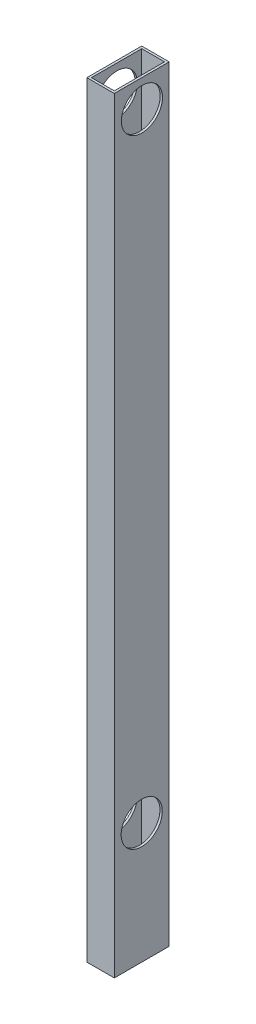
ISO-10303-21;
HEADER;
FILE_DESCRIPTION(('STEP AP214'),'2;1');
FILE_NAME('part.step','',(''),(''),'','','');
FILE_SCHEMA(('AUTOMOTIVE_DESIGN { 1 0 10303 214 1 1 1 1 }'));
ENDSEC;
DATA;
#1=APPLICATION_CONTEXT('core data for automotive mechanical design processes');
#2=APPLICATION_PROTOCOL_DEFINITION('international standard','automotive_design',2000,#1);
#3=PRODUCT_CONTEXT('',#1,'mechanical');
#4=PRODUCT('Part','Part','',(#3));
#5=PRODUCT_RELATED_PRODUCT_CATEGORY('part','',(#4));
#6=PRODUCT_DEFINITION_FORMATION('','',#4);
#7=PRODUCT_DEFINITION_CONTEXT('part definition',#1,'design');
#8=PRODUCT_DEFINITION('design','',#6,#7);
#9=PRODUCT_DEFINITION_SHAPE('','',#8);
#10=(LENGTH_UNIT() NAMED_UNIT(*) SI_UNIT(.MILLI.,.METRE.));
#11=(NAMED_UNIT(*) PLANE_ANGLE_UNIT() SI_UNIT($,.RADIAN.));
#12=(NAMED_UNIT(*) SI_UNIT($,.STERADIAN.) SOLID_ANGLE_UNIT());
#13=UNCERTAINTY_MEASURE_WITH_UNIT(LENGTH_MEASURE(1.E-05),#10,'distance_accuracy_value','');
#14=(GEOMETRIC_REPRESENTATION_CONTEXT(3) GLOBAL_UNCERTAINTY_ASSIGNED_CONTEXT((#13)) GLOBAL_UNIT_ASSIGNED_CONTEXT((#10,
#11,#12)) REPRESENTATION_CONTEXT('',''));
#15=CARTESIAN_POINT('',(0.,0.,0.));
#16=DIRECTION('',(0.,0.,1.));
#17=DIRECTION('',(1.,0.,0.));
#18=AXIS2_PLACEMENT_3D('',#15,#16,#17);
#19=CARTESIAN_POINT('',(0.,457.2,0.));
#20=DIRECTION('',(0.,1.,0.));
#21=DIRECTION('',(0.,0.,1.));
#22=AXIS2_PLACEMENT_3D('',#19,#20,#21);
#23=PLANE('',#22);
#24=DIRECTION('',(0.,0.,1.));
#25=VECTOR('',#24,1.);
#26=CARTESIAN_POINT('',(0.,457.2,0.));
#27=LINE('',#26,#25);
#28=CARTESIAN_POINT('',(0.,457.2,-38.1));
#29=VERTEX_POINT('',#28);
#30=CARTESIAN_POINT('',(0.,457.2,0.));
#31=VERTEX_POINT('',#30);
#32=EDGE_CURVE('E200',#29,#31,#27,.T.);
#33=ORIENTED_EDGE('',*,*,#32,.T.);
#34=DIRECTION('',(1.,0.,0.));
#35=VECTOR('',#34,1.);
#36=CARTESIAN_POINT('',(0.,457.2,0.));
#37=LINE('',#36,#35);
#38=CARTESIAN_POINT('',(19.05,457.2,0.));
#39=VERTEX_POINT('',#38);
#40=EDGE_CURVE('E202',#31,#39,#37,.T.);
#41=ORIENTED_EDGE('',*,*,#40,.T.);
#42=DIRECTION('',(0.,0.,-1.));
#43=VECTOR('',#42,1.);
#44=CARTESIAN_POINT('',(19.05,457.2,0.));
#45=LINE('',#44,#43);
#46=CARTESIAN_POINT('',(19.05,457.2,-38.1));
#47=VERTEX_POINT('',#46);
#48=EDGE_CURVE('E204',#39,#47,#45,.T.);
#49=ORIENTED_EDGE('',*,*,#48,.T.);
#50=DIRECTION('',(-1.,0.,0.));
#51=VECTOR('',#50,1.);
#52=CARTESIAN_POINT('',(0.,457.2,-38.1));
#53=LINE('',#52,#51);
#54=EDGE_CURVE('E106',#47,#29,#53,.T.);
#55=ORIENTED_EDGE('',*,*,#54,.T.);
#56=EDGE_LOOP('',(#33,#41,#49,#55));
#57=FACE_BOUND('',#56,.T.);
#58=DIRECTION('',(1.,0.,0.));
#59=VECTOR('',#58,1.);
#60=CARTESIAN_POINT('',(0.,457.2,-1.5875));
#61=LINE('',#60,#59);
#62=CARTESIAN_POINT('',(1.5875,457.2,-1.5875));
#63=VERTEX_POINT('',#62);
#64=CARTESIAN_POINT('',(17.4625,457.2,-1.5875));
#65=VERTEX_POINT('',#64);
#66=EDGE_CURVE('E156',#63,#65,#61,.T.);
#67=ORIENTED_EDGE('',*,*,#66,.F.);
#68=DIRECTION('',(0.,0.,1.));
#69=VECTOR('',#68,1.);
#70=CARTESIAN_POINT('',(1.5875,457.2,0.));
#71=LINE('',#70,#69);
#72=CARTESIAN_POINT('',(1.5875,457.2,-36.5125));
#73=VERTEX_POINT('',#72);
#74=EDGE_CURVE('E189',#73,#63,#71,.T.);
#75=ORIENTED_EDGE('',*,*,#74,.F.);
#76=DIRECTION('',(-1.,0.,0.));
#77=VECTOR('',#76,1.);
#78=CARTESIAN_POINT('',(0.,457.2,-36.5125));
#79=LINE('',#78,#77);
#80=CARTESIAN_POINT('',(17.4625,457.2,-36.5125));
#81=VERTEX_POINT('',#80);
#82=EDGE_CURVE('E194',#81,#73,#79,.T.);
#83=ORIENTED_EDGE('',*,*,#82,.F.);
#84=DIRECTION('',(0.,0.,-1.));
#85=VECTOR('',#84,1.);
#86=CARTESIAN_POINT('',(17.4625,457.2,0.));
#87=LINE('',#86,#85);
#88=EDGE_CURVE('E192',#65,#81,#87,.T.);
#89=ORIENTED_EDGE('',*,*,#88,.F.);
#90=EDGE_LOOP('',(#67,#75,#83,#89));
#91=FACE_BOUND('',#90,.T.);
#92=ADVANCED_FACE('F81',(#57,#91),#23,.T.);
#93=CARTESIAN_POINT('',(0.,457.2,0.));
#94=DIRECTION('',(1.,0.,0.));
#95=DIRECTION('',(0.,0.,-1.));
#96=AXIS2_PLACEMENT_3D('',#93,#94,#95);
#97=PLANE('',#96);
#98=CARTESIAN_POINT('',(0.,8.63599999999998,-19.05));
#99=DIRECTION('',(1.,0.,0.));
#100=DIRECTION('',(0.,0.,-1.));
#101=AXIS2_PLACEMENT_3D('',#98,#99,#100);
#102=CIRCLE('',#101,14.2875);
#103=CARTESIAN_POINT('',(0.,8.63599999999998,-33.3375));
#104=VERTEX_POINT('',#103);
#105=EDGE_CURVE('E231',#104,#104,#102,.T.);
#106=ORIENTED_EDGE('',*,*,#105,.T.);
#107=EDGE_LOOP('',(#106));
#108=FACE_BOUND('',#107,.T.);
#109=CARTESIAN_POINT('',(0.,438.15,-19.2024));
#110=DIRECTION('',(1.,0.,0.));
#111=DIRECTION('',(0.,0.,-1.));
#112=AXIS2_PLACEMENT_3D('',#109,#110,#111);
#113=CIRCLE('',#112,14.2875);
#114=CARTESIAN_POINT('',(0.,438.15,-33.4899));
#115=VERTEX_POINT('',#114);
#116=EDGE_CURVE('E213',#115,#115,#113,.T.);
#117=ORIENTED_EDGE('',*,*,#116,.T.);
#118=EDGE_LOOP('',(#117));
#119=FACE_BOUND('',#118,.T.);
#120=DIRECTION('',(0.,-1.,0.));
#121=VECTOR('',#120,1.);
#122=CARTESIAN_POINT('',(0.,457.2,-38.1));
#123=LINE('',#122,#121);
#124=CARTESIAN_POINT('',(0.,-75.184,-38.1));
#125=VERTEX_POINT('',#124);
#126=EDGE_CURVE('E207',#29,#125,#123,.T.);
#127=ORIENTED_EDGE('',*,*,#126,.T.);
#128=DIRECTION('',(0.,0.,-1.));
#129=VECTOR('',#128,1.);
#130=CARTESIAN_POINT('',(0.,-75.184,-38.1));
#131=LINE('',#130,#129);
#132=CARTESIAN_POINT('',(0.,-75.184,0.));
#133=VERTEX_POINT('',#132);
#134=EDGE_CURVE('E183',#133,#125,#131,.T.);
#135=ORIENTED_EDGE('',*,*,#134,.F.);
#136=DIRECTION('',(0.,-1.,0.));
#137=VECTOR('',#136,1.);
#138=CARTESIAN_POINT('',(0.,457.2,0.));
#139=LINE('',#138,#137);
#140=EDGE_CURVE('E12',#31,#133,#139,.T.);
#141=ORIENTED_EDGE('',*,*,#140,.F.);
#142=ORIENTED_EDGE('',*,*,#32,.F.);
#143=EDGE_LOOP('',(#127,#135,#141,#142));
#144=FACE_BOUND('',#143,.T.);
#145=ADVANCED_FACE('F83',(#108,#119,#144),#97,.F.);
#146=CARTESIAN_POINT('',(0.,457.2,0.));
#147=DIRECTION('',(0.,0.,-1.));
#148=DIRECTION('',(-1.,0.,0.));
#149=AXIS2_PLACEMENT_3D('',#146,#147,#148);
#150=PLANE('',#149);
#151=ORIENTED_EDGE('',*,*,#140,.T.);
#152=DIRECTION('',(-1.,0.,0.));
#153=VECTOR('',#152,1.);
#154=CARTESIAN_POINT('',(19.05,-75.184,0.));
#155=LINE('',#154,#153);
#156=CARTESIAN_POINT('',(19.05,-75.184,0.));
#157=VERTEX_POINT('',#156);
#158=EDGE_CURVE('E180',#157,#133,#155,.T.);
#159=ORIENTED_EDGE('',*,*,#158,.F.);
#160=DIRECTION('',(0.,-1.,0.));
#161=VECTOR('',#160,1.);
#162=CARTESIAN_POINT('',(19.05,457.2,0.));
#163=LINE('',#162,#161);
#164=EDGE_CURVE('E90',#39,#157,#163,.T.);
#165=ORIENTED_EDGE('',*,*,#164,.F.);
#166=ORIENTED_EDGE('',*,*,#40,.F.);
#167=EDGE_LOOP('',(#151,#159,#165,#166));
#168=FACE_BOUND('',#167,.T.);
#169=ADVANCED_FACE('F257',(#168),#150,.F.);
#170=CARTESIAN_POINT('',(19.05,457.2,0.));
#171=DIRECTION('',(-1.,0.,0.));
#172=DIRECTION('',(0.,0.,1.));
#173=AXIS2_PLACEMENT_3D('',#170,#171,#172);
#174=PLANE('',#173);
#175=CARTESIAN_POINT('',(19.05,8.63599999999998,-19.05));
#176=DIRECTION('',(1.,0.,0.));
#177=DIRECTION('',(0.,0.,-1.));
#178=AXIS2_PLACEMENT_3D('',#175,#176,#177);
#179=CIRCLE('',#178,14.2875);
#180=CARTESIAN_POINT('',(19.05,8.63599999999998,-33.3375));
#181=VERTEX_POINT('',#180);
#182=EDGE_CURVE('E228',#181,#181,#179,.T.);
#183=ORIENTED_EDGE('',*,*,#182,.F.);
#184=EDGE_LOOP('',(#183));
#185=FACE_BOUND('',#184,.T.);
#186=CARTESIAN_POINT('',(19.05,438.15,-19.2024));
#187=DIRECTION('',(1.,0.,0.));
#188=DIRECTION('',(0.,0.,-1.));
#189=AXIS2_PLACEMENT_3D('',#186,#187,#188);
#190=CIRCLE('',#189,14.2875);
#191=CARTESIAN_POINT('',(19.05,438.15,-33.4899));
#192=VERTEX_POINT('',#191);
#193=EDGE_CURVE('E218',#192,#192,#190,.T.);
#194=ORIENTED_EDGE('',*,*,#193,.F.);
#195=EDGE_LOOP('',(#194));
#196=FACE_BOUND('',#195,.T.);
#197=ORIENTED_EDGE('',*,*,#164,.T.);
#198=DIRECTION('',(0.,0.,1.));
#199=VECTOR('',#198,1.);
#200=CARTESIAN_POINT('',(19.05,-75.184,-38.1));
#201=LINE('',#200,#199);
#202=CARTESIAN_POINT('',(19.05,-75.184,-38.1));
#203=VERTEX_POINT('',#202);
#204=EDGE_CURVE('E177',#203,#157,#201,.T.);
#205=ORIENTED_EDGE('',*,*,#204,.F.);
#206=DIRECTION('',(0.,-1.,0.));
#207=VECTOR('',#206,1.);
#208=CARTESIAN_POINT('',(19.05,457.2,-38.1));
#209=LINE('',#208,#207);
#210=EDGE_CURVE('E209',#47,#203,#209,.T.);
#211=ORIENTED_EDGE('',*,*,#210,.F.);
#212=ORIENTED_EDGE('',*,*,#48,.F.);
#213=EDGE_LOOP('',(#197,#205,#211,#212));
#214=FACE_BOUND('',#213,.T.);
#215=ADVANCED_FACE('F264',(#185,#196,#214),#174,.F.);
#216=CARTESIAN_POINT('',(0.,457.2,-38.1));
#217=DIRECTION('',(0.,0.,1.));
#218=DIRECTION('',(1.,0.,0.));
#219=AXIS2_PLACEMENT_3D('',#216,#217,#218);
#220=PLANE('',#219);
#221=ORIENTED_EDGE('',*,*,#210,.T.);
#222=DIRECTION('',(1.,0.,0.));
#223=VECTOR('',#222,1.);
#224=CARTESIAN_POINT('',(19.05,-75.184,-38.1));
#225=LINE('',#224,#223);
#226=EDGE_CURVE('E186',#125,#203,#225,.T.);
#227=ORIENTED_EDGE('',*,*,#226,.F.);
#228=ORIENTED_EDGE('',*,*,#126,.F.);
#229=ORIENTED_EDGE('',*,*,#54,.F.);
#230=EDGE_LOOP('',(#221,#227,#228,#229));
#231=FACE_BOUND('',#230,.T.);
#232=ADVANCED_FACE('F261',(#231),#220,.F.);
#233=CARTESIAN_POINT('',(1.5875,457.2,0.));
#234=DIRECTION('',(1.,0.,0.));
#235=DIRECTION('',(0.,0.,-1.));
#236=AXIS2_PLACEMENT_3D('',#233,#234,#235);
#237=PLANE('',#236);
#238=CARTESIAN_POINT('',(1.5875,8.63599999999998,-19.05));
#239=DIRECTION('',(1.,0.,0.));
#240=DIRECTION('',(0.,0.,-1.));
#241=AXIS2_PLACEMENT_3D('',#238,#239,#240);
#242=CIRCLE('',#241,14.2875);
#243=CARTESIAN_POINT('',(1.5875,8.63599999999998,-33.3375));
#244=VERTEX_POINT('',#243);
#245=EDGE_CURVE('E223',#244,#244,#242,.T.);
#246=ORIENTED_EDGE('',*,*,#245,.F.);
#247=EDGE_LOOP('',(#246));
#248=FACE_BOUND('',#247,.T.);
#249=CARTESIAN_POINT('',(1.5875,438.15,-19.2024));
#250=DIRECTION('',(1.,0.,0.));
#251=DIRECTION('',(0.,0.,-1.));
#252=AXIS2_PLACEMENT_3D('',#249,#250,#251);
#253=CIRCLE('',#252,14.2875);
#254=CARTESIAN_POINT('',(1.5875,438.15,-33.4899));
#255=VERTEX_POINT('',#254);
#256=EDGE_CURVE('E166',#255,#255,#253,.T.);
#257=ORIENTED_EDGE('',*,*,#256,.F.);
#258=EDGE_LOOP('',(#257));
#259=FACE_BOUND('',#258,.T.);
#260=DIRECTION('',(0.,-1.,0.));
#261=VECTOR('',#260,1.);
#262=CARTESIAN_POINT('',(1.5875,457.2,-1.5875));
#263=LINE('',#262,#261);
#264=CARTESIAN_POINT('',(1.5875,-75.184,-1.5875));
#265=VERTEX_POINT('',#264);
#266=EDGE_CURVE('E159',#63,#265,#263,.T.);
#267=ORIENTED_EDGE('',*,*,#266,.T.);
#268=DIRECTION('',(0.,0.,-1.));
#269=VECTOR('',#268,1.);
#270=CARTESIAN_POINT('',(1.5875,-75.184,-38.1));
#271=LINE('',#270,#269);
#272=CARTESIAN_POINT('',(1.5875,-75.184,-36.5125));
#273=VERTEX_POINT('',#272);
#274=EDGE_CURVE('E170',#265,#273,#271,.T.);
#275=ORIENTED_EDGE('',*,*,#274,.T.);
#276=DIRECTION('',(0.,-1.,0.));
#277=VECTOR('',#276,1.);
#278=CARTESIAN_POINT('',(1.5875,457.2,-36.5125));
#279=LINE('',#278,#277);
#280=EDGE_CURVE('E196',#73,#273,#279,.T.);
#281=ORIENTED_EDGE('',*,*,#280,.F.);
#282=ORIENTED_EDGE('',*,*,#74,.T.);
#283=EDGE_LOOP('',(#267,#275,#281,#282));
#284=FACE_BOUND('',#283,.T.);
#285=ADVANCED_FACE('F250',(#248,#259,#284),#237,.T.);
#286=CARTESIAN_POINT('',(0.,457.2,-1.5875));
#287=DIRECTION('',(0.,0.,-1.));
#288=DIRECTION('',(-1.,0.,0.));
#289=AXIS2_PLACEMENT_3D('',#286,#287,#288);
#290=PLANE('',#289);
#291=DIRECTION('',(0.,-1.,0.));
#292=VECTOR('',#291,1.);
#293=CARTESIAN_POINT('',(17.4625,457.2,-1.5875));
#294=LINE('',#293,#292);
#295=CARTESIAN_POINT('',(17.4625,-75.184,-1.5875));
#296=VERTEX_POINT('',#295);
#297=EDGE_CURVE('E148',#65,#296,#294,.T.);
#298=ORIENTED_EDGE('',*,*,#297,.T.);
#299=DIRECTION('',(-1.,0.,0.));
#300=VECTOR('',#299,1.);
#301=CARTESIAN_POINT('',(19.05,-75.184,-1.5875));
#302=LINE('',#301,#300);
#303=EDGE_CURVE('E153',#296,#265,#302,.T.);
#304=ORIENTED_EDGE('',*,*,#303,.T.);
#305=ORIENTED_EDGE('',*,*,#266,.F.);
#306=ORIENTED_EDGE('',*,*,#66,.T.);
#307=EDGE_LOOP('',(#298,#304,#305,#306));
#308=FACE_BOUND('',#307,.T.);
#309=ADVANCED_FACE('F150',(#308),#290,.T.);
#310=CARTESIAN_POINT('',(17.4625,457.2,0.));
#311=DIRECTION('',(-1.,0.,0.));
#312=DIRECTION('',(0.,0.,1.));
#313=AXIS2_PLACEMENT_3D('',#310,#311,#312);
#314=PLANE('',#313);
#315=CARTESIAN_POINT('',(17.4625,8.63599999999998,-19.05));
#316=DIRECTION('',(-1.,0.,0.));
#317=DIRECTION('',(0.,0.,1.));
#318=AXIS2_PLACEMENT_3D('',#315,#316,#317);
#319=CIRCLE('',#318,14.2875);
#320=CARTESIAN_POINT('',(17.4625,8.63599999999998,-4.76249999999999));
#321=VERTEX_POINT('',#320);
#322=EDGE_CURVE('E85',#321,#321,#319,.T.);
#323=ORIENTED_EDGE('',*,*,#322,.F.);
#324=EDGE_LOOP('',(#323));
#325=FACE_BOUND('',#324,.T.);
#326=CARTESIAN_POINT('',(17.4625,438.15,-19.2024));
#327=DIRECTION('',(-1.,0.,0.));
#328=DIRECTION('',(0.,0.,1.));
#329=AXIS2_PLACEMENT_3D('',#326,#327,#328);
#330=CIRCLE('',#329,14.2875);
#331=CARTESIAN_POINT('',(17.4625,438.15,-4.9149));
#332=VERTEX_POINT('',#331);
#333=EDGE_CURVE('E211',#332,#332,#330,.T.);
#334=ORIENTED_EDGE('',*,*,#333,.F.);
#335=EDGE_LOOP('',(#334));
#336=FACE_BOUND('',#335,.T.);
#337=DIRECTION('',(0.,-1.,0.));
#338=VECTOR('',#337,1.);
#339=CARTESIAN_POINT('',(17.4625,457.2,-36.5125));
#340=LINE('',#339,#338);
#341=CARTESIAN_POINT('',(17.4625,-75.184,-36.5125));
#342=VERTEX_POINT('',#341);
#343=EDGE_CURVE('E98',#81,#342,#340,.T.);
#344=ORIENTED_EDGE('',*,*,#343,.T.);
#345=DIRECTION('',(0.,0.,1.));
#346=VECTOR('',#345,1.);
#347=CARTESIAN_POINT('',(17.4625,-75.184,-38.1));
#348=LINE('',#347,#346);
#349=EDGE_CURVE('E162',#342,#296,#348,.T.);
#350=ORIENTED_EDGE('',*,*,#349,.T.);
#351=ORIENTED_EDGE('',*,*,#297,.F.);
#352=ORIENTED_EDGE('',*,*,#88,.T.);
#353=EDGE_LOOP('',(#344,#350,#351,#352));
#354=FACE_BOUND('',#353,.T.);
#355=ADVANCED_FACE('F163',(#325,#336,#354),#314,.T.);
#356=CARTESIAN_POINT('',(0.,457.2,-36.5125));
#357=DIRECTION('',(0.,0.,1.));
#358=DIRECTION('',(1.,0.,0.));
#359=AXIS2_PLACEMENT_3D('',#356,#357,#358);
#360=PLANE('',#359);
#361=ORIENTED_EDGE('',*,*,#280,.T.);
#362=DIRECTION('',(1.,0.,0.));
#363=VECTOR('',#362,1.);
#364=CARTESIAN_POINT('',(19.05,-75.184,-36.5125));
#365=LINE('',#364,#363);
#366=EDGE_CURVE('E172',#273,#342,#365,.T.);
#367=ORIENTED_EDGE('',*,*,#366,.T.);
#368=ORIENTED_EDGE('',*,*,#343,.F.);
#369=ORIENTED_EDGE('',*,*,#82,.T.);
#370=EDGE_LOOP('',(#361,#367,#368,#369));
#371=FACE_BOUND('',#370,.T.);
#372=ADVANCED_FACE('F243',(#371),#360,.T.);
#373=CARTESIAN_POINT('',(0.,-75.184,0.));
#374=DIRECTION('',(0.,-1.,0.));
#375=DIRECTION('',(0.,0.,-1.));
#376=AXIS2_PLACEMENT_3D('',#373,#374,#375);
#377=PLANE('',#376);
#378=ORIENTED_EDGE('',*,*,#204,.T.);
#379=ORIENTED_EDGE('',*,*,#158,.T.);
#380=ORIENTED_EDGE('',*,*,#134,.T.);
#381=ORIENTED_EDGE('',*,*,#226,.T.);
#382=EDGE_LOOP('',(#378,#379,#380,#381));
#383=FACE_BOUND('',#382,.T.);
#384=ORIENTED_EDGE('',*,*,#303,.F.);
#385=ORIENTED_EDGE('',*,*,#349,.F.);
#386=ORIENTED_EDGE('',*,*,#366,.F.);
#387=ORIENTED_EDGE('',*,*,#274,.F.);
#388=EDGE_LOOP('',(#384,#385,#386,#387));
#389=FACE_BOUND('',#388,.T.);
#390=ADVANCED_FACE('F168',(#383,#389),#377,.T.);
#391=CARTESIAN_POINT('',(0.,438.15,-19.2024));
#392=DIRECTION('',(1.,0.,0.));
#393=DIRECTION('',(0.,0.,-1.));
#394=AXIS2_PLACEMENT_3D('',#391,#392,#393);
#395=CYLINDRICAL_SURFACE('',#394,14.2875);
#396=ORIENTED_EDGE('',*,*,#333,.T.);
#397=EDGE_LOOP('',(#396));
#398=FACE_BOUND('',#397,.T.);
#399=ORIENTED_EDGE('',*,*,#193,.T.);
#400=EDGE_LOOP('',(#399));
#401=FACE_BOUND('',#400,.T.);
#402=ADVANCED_FACE('F285',(#398,#401),#395,.F.);
#403=ORIENTED_EDGE('',*,*,#256,.T.);
#404=EDGE_LOOP('',(#403));
#405=FACE_BOUND('',#404,.T.);
#406=ORIENTED_EDGE('',*,*,#116,.F.);
#407=EDGE_LOOP('',(#406));
#408=FACE_BOUND('',#407,.T.);
#409=ADVANCED_FACE('F290',(#405,#408),#395,.F.);
#410=CARTESIAN_POINT('',(0.,8.63599999999998,-19.05));
#411=DIRECTION('',(1.,0.,0.));
#412=DIRECTION('',(0.,0.,-1.));
#413=AXIS2_PLACEMENT_3D('',#410,#411,#412);
#414=CYLINDRICAL_SURFACE('',#413,14.2875);
#415=ORIENTED_EDGE('',*,*,#322,.T.);
#416=EDGE_LOOP('',(#415));
#417=FACE_BOUND('',#416,.T.);
#418=ORIENTED_EDGE('',*,*,#182,.T.);
#419=EDGE_LOOP('',(#418));
#420=FACE_BOUND('',#419,.T.);
#421=ADVANCED_FACE('F238',(#417,#420),#414,.F.);
#422=ORIENTED_EDGE('',*,*,#245,.T.);
#423=EDGE_LOOP('',(#422));
#424=FACE_BOUND('',#423,.T.);
#425=ORIENTED_EDGE('',*,*,#105,.F.);
#426=EDGE_LOOP('',(#425));
#427=FACE_BOUND('',#426,.T.);
#428=ADVANCED_FACE('F294',(#424,#427),#414,.F.);
#429=CLOSED_SHELL('',(#92,#145,#169,#215,#232,#285,#309,#355,#372,#390,#402,#409,#421,#428));
#430=MANIFOLD_SOLID_BREP('B2',#429);
#431=ADVANCED_BREP_SHAPE_REPRESENTATION('',(#18,#430),#14);
#432=SHAPE_DEFINITION_REPRESENTATION(#9,#431);
ENDSEC;
END-ISO-10303-21;
